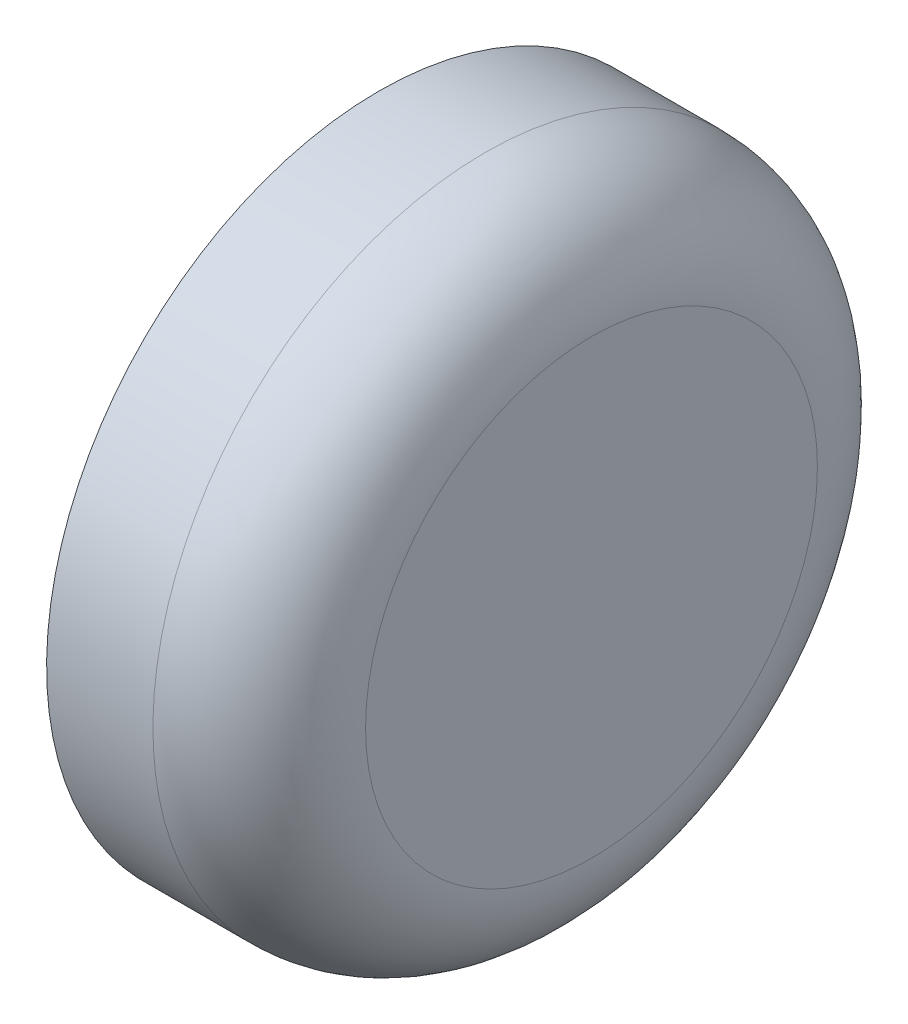
ISO-10303-21;
HEADER;
FILE_DESCRIPTION(('STEP AP214'),'2;1');
FILE_NAME('part.step','',(''),(''),'','','');
FILE_SCHEMA(('AUTOMOTIVE_DESIGN { 1 0 10303 214 1 1 1 1 }'));
ENDSEC;
DATA;
#1=APPLICATION_CONTEXT('core data for automotive mechanical design processes');
#2=APPLICATION_PROTOCOL_DEFINITION('international standard','automotive_design',2000,#1);
#3=PRODUCT_CONTEXT('',#1,'mechanical');
#4=PRODUCT('Part','Part','',(#3));
#5=PRODUCT_RELATED_PRODUCT_CATEGORY('part','',(#4));
#6=PRODUCT_DEFINITION_FORMATION('','',#4);
#7=PRODUCT_DEFINITION_CONTEXT('part definition',#1,'design');
#8=PRODUCT_DEFINITION('design','',#6,#7);
#9=PRODUCT_DEFINITION_SHAPE('','',#8);
#10=(LENGTH_UNIT() NAMED_UNIT(*) SI_UNIT(.MILLI.,.METRE.));
#11=(NAMED_UNIT(*) PLANE_ANGLE_UNIT() SI_UNIT($,.RADIAN.));
#12=(NAMED_UNIT(*) SI_UNIT($,.STERADIAN.) SOLID_ANGLE_UNIT());
#13=UNCERTAINTY_MEASURE_WITH_UNIT(LENGTH_MEASURE(1.E-05),#10,'distance_accuracy_value','');
#14=(GEOMETRIC_REPRESENTATION_CONTEXT(3) GLOBAL_UNCERTAINTY_ASSIGNED_CONTEXT((#13)) GLOBAL_UNIT_ASSIGNED_CONTEXT((#10,
#11,#12)) REPRESENTATION_CONTEXT('',''));
#15=CARTESIAN_POINT('',(0.,0.,0.));
#16=DIRECTION('',(0.,0.,1.));
#17=DIRECTION('',(1.,0.,0.));
#18=AXIS2_PLACEMENT_3D('',#15,#16,#17);
#19=CARTESIAN_POINT('',(0.404635714690617,-0.332340218761648,0.1012));
#20=DIRECTION('',(1.,0.,0.));
#21=DIRECTION('',(0.,1.,0.));
#22=AXIS2_PLACEMENT_3D('',#19,#20,#21);
#23=PLANE('',#22);
#24=CARTESIAN_POINT('',(0.404635714690617,-0.332340218761648,0.1012));
#25=DIRECTION('',(-1.,0.,0.));
#26=DIRECTION('',(0.,0.,1.));
#27=AXIS2_PLACEMENT_3D('',#24,#25,#26);
#28=CIRCLE('',#27,0.02125);
#29=CARTESIAN_POINT('',(0.404635714690617,-0.332340218761648,0.12245));
#30=VERTEX_POINT('',#29);
#31=CARTESIAN_POINT('',(0.404635714690617,-0.311090218761648,0.1012));
#32=VERTEX_POINT('',#31);
#33=EDGE_CURVE('E41',#30,#32,#28,.T.);
#34=ORIENTED_EDGE('',*,*,#33,.F.);
#35=CARTESIAN_POINT('',(0.404635714690617,-0.332340218761648,0.1012));
#36=DIRECTION('',(-1.,0.,0.));
#37=DIRECTION('',(0.,0.,-1.));
#38=AXIS2_PLACEMENT_3D('',#35,#36,#37);
#39=CIRCLE('',#38,0.0212499999999999);
#40=CARTESIAN_POINT('',(0.404635714690617,-0.332340218761648,0.07995));
#41=VERTEX_POINT('',#40);
#42=EDGE_CURVE('E43',#41,#30,#39,.T.);
#43=ORIENTED_EDGE('',*,*,#42,.F.);
#44=CARTESIAN_POINT('',(0.404635714690617,-0.332340218761648,0.1012));
#45=DIRECTION('',(-1.,0.,0.));
#46=DIRECTION('',(0.,1.,0.));
#47=AXIS2_PLACEMENT_3D('',#44,#45,#46);
#48=CIRCLE('',#47,0.02125);
#49=EDGE_CURVE('E35',#32,#41,#48,.T.);
#50=ORIENTED_EDGE('',*,*,#49,.F.);
#51=EDGE_LOOP('',(#34,#43,#50));
#52=FACE_BOUND('',#51,.T.);
#53=ADVANCED_FACE('F17',(#52),#23,.T.);
#54=CARTESIAN_POINT('',(0.394635714690617,-0.332340218761648,0.1012));
#55=DIRECTION('',(1.,0.,0.));
#56=DIRECTION('',(0.,0.,1.));
#57=AXIS2_PLACEMENT_3D('',#54,#55,#56);
#58=TOROIDAL_SURFACE('',#57,0.02125,0.01);
#59=ORIENTED_EDGE('',*,*,#42,.T.);
#60=ORIENTED_EDGE('',*,*,#33,.T.);
#61=ORIENTED_EDGE('',*,*,#49,.T.);
#62=EDGE_LOOP('',(#59,#60,#61));
#63=FACE_BOUND('',#62,.T.);
#64=CARTESIAN_POINT('',(0.394635714690617,-0.332340218761648,0.1012));
#65=DIRECTION('',(1.,0.,0.));
#66=DIRECTION('',(0.,1.,0.));
#67=AXIS2_PLACEMENT_3D('',#64,#65,#66);
#68=CIRCLE('',#67,0.03125);
#69=CARTESIAN_POINT('',(0.394635714690617,-0.301090218761648,0.1012));
#70=VERTEX_POINT('',#69);
#71=EDGE_CURVE('E27',#70,#70,#68,.F.);
#72=ORIENTED_EDGE('',*,*,#71,.F.);
#73=EDGE_LOOP('',(#72));
#74=FACE_BOUND('',#73,.T.);
#75=ADVANCED_FACE('F44',(#63,#74),#58,.T.);
#76=CARTESIAN_POINT('',(0.404635714690617,-0.332340218761648,0.1012));
#77=DIRECTION('',(1.,0.,0.));
#78=DIRECTION('',(0.,1.,0.));
#79=AXIS2_PLACEMENT_3D('',#76,#77,#78);
#80=CYLINDRICAL_SURFACE('',#79,0.03125);
#81=CARTESIAN_POINT('',(0.384635714690617,-0.332340218761648,0.1012));
#82=DIRECTION('',(1.,0.,0.));
#83=DIRECTION('',(0.,1.,0.));
#84=AXIS2_PLACEMENT_3D('',#81,#82,#83);
#85=CIRCLE('',#84,0.03125);
#86=CARTESIAN_POINT('',(0.384635714690617,-0.301090218761648,0.1012));
#87=VERTEX_POINT('',#86);
#88=EDGE_CURVE('E11',#87,#87,#85,.T.);
#89=ORIENTED_EDGE('',*,*,#88,.T.);
#90=EDGE_LOOP('',(#89));
#91=FACE_BOUND('',#90,.T.);
#92=ORIENTED_EDGE('',*,*,#71,.T.);
#93=EDGE_LOOP('',(#92));
#94=FACE_BOUND('',#93,.T.);
#95=ADVANCED_FACE('F82',(#91,#94),#80,.T.);
#96=CARTESIAN_POINT('',(0.384635714690617,-0.332340218761648,0.1012));
#97=DIRECTION('',(1.,0.,0.));
#98=DIRECTION('',(0.,1.,0.));
#99=AXIS2_PLACEMENT_3D('',#96,#97,#98);
#100=PLANE('',#99);
#101=ORIENTED_EDGE('',*,*,#88,.F.);
#102=EDGE_LOOP('',(#101));
#103=FACE_BOUND('',#102,.T.);
#104=ADVANCED_FACE('F92',(#103),#100,.F.);
#105=CLOSED_SHELL('',(#53,#75,#95,#104));
#106=MANIFOLD_SOLID_BREP('B1',#105);
#107=ADVANCED_BREP_SHAPE_REPRESENTATION('',(#18,#106),#14);
#108=SHAPE_DEFINITION_REPRESENTATION(#9,#107);
ENDSEC;
END-ISO-10303-21;
